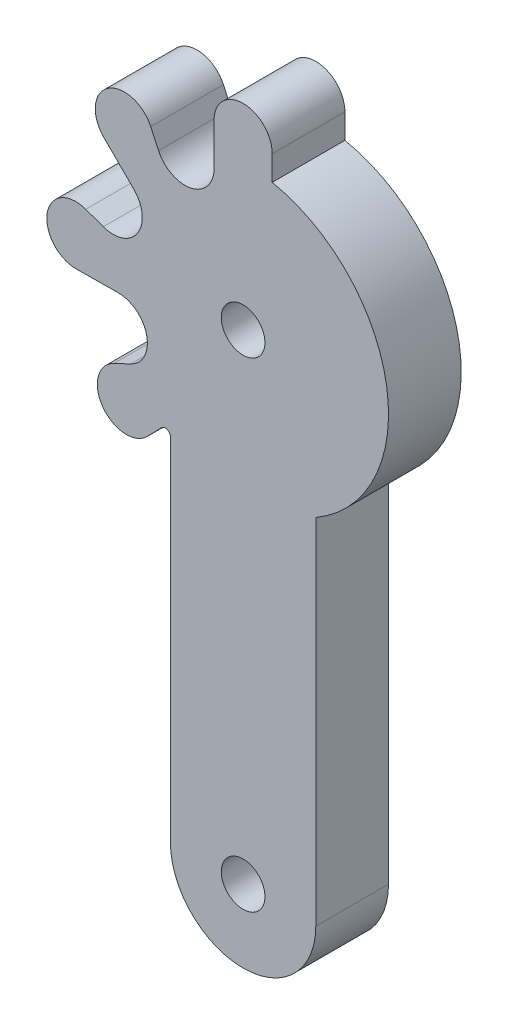
ISO-10303-21;
HEADER;
FILE_DESCRIPTION(('STEP AP214'),'2;1');
FILE_NAME('part.step','',(''),(''),'','','');
FILE_SCHEMA(('AUTOMOTIVE_DESIGN { 1 0 10303 214 1 1 1 1 }'));
ENDSEC;
DATA;
#1=APPLICATION_CONTEXT('core data for automotive mechanical design processes');
#2=APPLICATION_PROTOCOL_DEFINITION('international standard','automotive_design',2000,#1);
#3=PRODUCT_CONTEXT('',#1,'mechanical');
#4=PRODUCT('Part','Part','',(#3));
#5=PRODUCT_RELATED_PRODUCT_CATEGORY('part','',(#4));
#6=PRODUCT_DEFINITION_FORMATION('','',#4);
#7=PRODUCT_DEFINITION_CONTEXT('part definition',#1,'design');
#8=PRODUCT_DEFINITION('design','',#6,#7);
#9=PRODUCT_DEFINITION_SHAPE('','',#8);
#10=(LENGTH_UNIT() NAMED_UNIT(*) SI_UNIT(.MILLI.,.METRE.));
#11=(NAMED_UNIT(*) PLANE_ANGLE_UNIT() SI_UNIT($,.RADIAN.));
#12=(NAMED_UNIT(*) SI_UNIT($,.STERADIAN.) SOLID_ANGLE_UNIT());
#13=UNCERTAINTY_MEASURE_WITH_UNIT(LENGTH_MEASURE(1.E-05),#10,'distance_accuracy_value','');
#14=(GEOMETRIC_REPRESENTATION_CONTEXT(3) GLOBAL_UNCERTAINTY_ASSIGNED_CONTEXT((#13)) GLOBAL_UNIT_ASSIGNED_CONTEXT((#10,
#11,#12)) REPRESENTATION_CONTEXT('',''));
#15=CARTESIAN_POINT('',(0.,0.,0.));
#16=DIRECTION('',(0.,0.,1.));
#17=DIRECTION('',(1.,0.,0.));
#18=AXIS2_PLACEMENT_3D('',#15,#16,#17);
#19=CARTESIAN_POINT('',(-5.35045624859812,-8.86028004557311,5.));
#20=DIRECTION('',(0.,0.,-1.));
#21=DIRECTION('',(-1.,0.,0.));
#22=AXIS2_PLACEMENT_3D('',#19,#20,#21);
#23=CYLINDRICAL_SURFACE('',#22,0.350456248598112);
#24=CARTESIAN_POINT('',(-5.35045624859812,-8.86028004557311,0.));
#25=DIRECTION('',(0.,0.,1.));
#26=DIRECTION('',(1.,0.,0.));
#27=AXIS2_PLACEMENT_3D('',#24,#25,#26);
#28=CIRCLE('',#27,0.350456248598112);
#29=CARTESIAN_POINT('',(-5.00000000000001,-8.86028004557311,0.));
#30=VERTEX_POINT('',#29);
#31=CARTESIAN_POINT('',(-5.60147953192162,-8.61572556613968,0.));
#32=VERTEX_POINT('',#31);
#33=EDGE_CURVE('E254',#30,#32,#28,.T.);
#34=ORIENTED_EDGE('',*,*,#33,.F.);
#35=DIRECTION('',(0.,0.,-1.));
#36=VECTOR('',#35,1.);
#37=CARTESIAN_POINT('',(-5.00000000000001,-8.86028004557311,5.));
#38=LINE('',#37,#36);
#39=CARTESIAN_POINT('',(-5.00000000000001,-8.86028004557311,5.));
#40=VERTEX_POINT('',#39);
#41=EDGE_CURVE('E11',#40,#30,#38,.T.);
#42=ORIENTED_EDGE('',*,*,#41,.F.);
#43=CARTESIAN_POINT('',(-5.35045624859812,-8.86028004557311,5.));
#44=DIRECTION('',(0.,0.,1.));
#45=DIRECTION('',(1.,0.,0.));
#46=AXIS2_PLACEMENT_3D('',#43,#44,#45);
#47=CIRCLE('',#46,0.350456248598112);
#48=CARTESIAN_POINT('',(-5.60147953192162,-8.61572556613968,5.));
#49=VERTEX_POINT('',#48);
#50=EDGE_CURVE('E407',#40,#49,#47,.T.);
#51=ORIENTED_EDGE('',*,*,#50,.T.);
#52=DIRECTION('',(0.,0.,-1.));
#53=VECTOR('',#52,1.);
#54=CARTESIAN_POINT('',(-5.60147953192162,-8.61572556613968,5.));
#55=LINE('',#54,#53);
#56=EDGE_CURVE('E123',#49,#32,#55,.T.);
#57=ORIENTED_EDGE('',*,*,#56,.T.);
#58=EDGE_LOOP('',(#34,#42,#51,#57));
#59=FACE_BOUND('',#58,.T.);
#60=ADVANCED_FACE('F36',(#59),#23,.F.);
#61=CARTESIAN_POINT('',(-5.,0.,5.));
#62=DIRECTION('',(1.,0.,0.));
#63=DIRECTION('',(0.,1.,0.));
#64=AXIS2_PLACEMENT_3D('',#61,#62,#63);
#65=PLANE('',#64);
#66=DIRECTION('',(0.,-1.,0.));
#67=VECTOR('',#66,1.);
#68=CARTESIAN_POINT('',(-5.,0.,0.));
#69=LINE('',#68,#67);
#70=CARTESIAN_POINT('',(-5.00000000000005,-33.,0.));
#71=VERTEX_POINT('',#70);
#72=EDGE_CURVE('E252',#30,#71,#69,.T.);
#73=ORIENTED_EDGE('',*,*,#72,.T.);
#74=DIRECTION('',(0.,0.,-1.));
#75=VECTOR('',#74,1.);
#76=CARTESIAN_POINT('',(-5.00000000000005,-33.,5.));
#77=LINE('',#76,#75);
#78=CARTESIAN_POINT('',(-5.00000000000005,-33.,5.));
#79=VERTEX_POINT('',#78);
#80=EDGE_CURVE('E45',#79,#71,#77,.T.);
#81=ORIENTED_EDGE('',*,*,#80,.F.);
#82=DIRECTION('',(0.,-1.,0.));
#83=VECTOR('',#82,1.);
#84=CARTESIAN_POINT('',(-5.,0.,5.));
#85=LINE('',#84,#83);
#86=EDGE_CURVE('E409',#40,#79,#85,.T.);
#87=ORIENTED_EDGE('',*,*,#86,.F.);
#88=ORIENTED_EDGE('',*,*,#41,.T.);
#89=EDGE_LOOP('',(#73,#81,#87,#88));
#90=FACE_BOUND('',#89,.T.);
#91=ADVANCED_FACE('F253',(#90),#65,.F.);
#92=CARTESIAN_POINT('',(0.,-33.,5.));
#93=DIRECTION('',(0.,0.,-1.));
#94=DIRECTION('',(-1.,0.,0.));
#95=AXIS2_PLACEMENT_3D('',#92,#93,#94);
#96=CYLINDRICAL_SURFACE('',#95,5.00000000000002);
#97=CARTESIAN_POINT('',(0.,-33.,0.));
#98=DIRECTION('',(0.,0.,1.));
#99=DIRECTION('',(1.,0.,0.));
#100=AXIS2_PLACEMENT_3D('',#97,#98,#99);
#101=CIRCLE('',#100,5.00000000000002);
#102=CARTESIAN_POINT('',(5.,-33.,0.));
#103=VERTEX_POINT('',#102);
#104=EDGE_CURVE('E246',#71,#103,#101,.T.);
#105=ORIENTED_EDGE('',*,*,#104,.T.);
#106=DIRECTION('',(0.,0.,-1.));
#107=VECTOR('',#106,1.);
#108=CARTESIAN_POINT('',(5.,-33.,5.));
#109=LINE('',#108,#107);
#110=CARTESIAN_POINT('',(5.,-33.,5.));
#111=VERTEX_POINT('',#110);
#112=EDGE_CURVE('E238',#111,#103,#109,.T.);
#113=ORIENTED_EDGE('',*,*,#112,.F.);
#114=CARTESIAN_POINT('',(0.,-33.,5.));
#115=DIRECTION('',(0.,0.,1.));
#116=DIRECTION('',(1.,0.,0.));
#117=AXIS2_PLACEMENT_3D('',#114,#115,#116);
#118=CIRCLE('',#117,5.00000000000002);
#119=EDGE_CURVE('E248',#79,#111,#118,.T.);
#120=ORIENTED_EDGE('',*,*,#119,.F.);
#121=ORIENTED_EDGE('',*,*,#80,.T.);
#122=EDGE_LOOP('',(#105,#113,#120,#121));
#123=FACE_BOUND('',#122,.T.);
#124=ADVANCED_FACE('F244',(#123),#96,.T.);
#125=CARTESIAN_POINT('',(5.,0.,5.));
#126=DIRECTION('',(1.,0.,0.));
#127=DIRECTION('',(0.,1.,0.));
#128=AXIS2_PLACEMENT_3D('',#125,#126,#127);
#129=PLANE('',#128);
#130=DIRECTION('',(0.,-1.,0.));
#131=VECTOR('',#130,1.);
#132=CARTESIAN_POINT('',(5.,0.,0.));
#133=LINE('',#132,#131);
#134=CARTESIAN_POINT('',(5.,-8.66025403784439,0.));
#135=VERTEX_POINT('',#134);
#136=EDGE_CURVE('E256',#135,#103,#133,.T.);
#137=ORIENTED_EDGE('',*,*,#136,.F.);
#138=DIRECTION('',(0.,0.,-1.));
#139=VECTOR('',#138,1.);
#140=CARTESIAN_POINT('',(5.,-8.66025403784439,5.));
#141=LINE('',#140,#139);
#142=CARTESIAN_POINT('',(5.,-8.66025403784439,5.));
#143=VERTEX_POINT('',#142);
#144=EDGE_CURVE('E236',#143,#135,#141,.T.);
#145=ORIENTED_EDGE('',*,*,#144,.F.);
#146=DIRECTION('',(0.,-1.,0.));
#147=VECTOR('',#146,1.);
#148=CARTESIAN_POINT('',(5.,0.,5.));
#149=LINE('',#148,#147);
#150=EDGE_CURVE('E414',#143,#111,#149,.T.);
#151=ORIENTED_EDGE('',*,*,#150,.T.);
#152=ORIENTED_EDGE('',*,*,#112,.T.);
#153=EDGE_LOOP('',(#137,#145,#151,#152));
#154=FACE_BOUND('',#153,.T.);
#155=ADVANCED_FACE('F340',(#154),#129,.T.);
#156=CARTESIAN_POINT('',(0.,0.,5.));
#157=DIRECTION('',(0.,0.,-1.));
#158=DIRECTION('',(-1.,0.,0.));
#159=AXIS2_PLACEMENT_3D('',#156,#157,#158);
#160=CYLINDRICAL_SURFACE('',#159,10.);
#161=CARTESIAN_POINT('',(0.,0.,0.));
#162=DIRECTION('',(0.,0.,1.));
#163=DIRECTION('',(1.,0.,0.));
#164=AXIS2_PLACEMENT_3D('',#161,#162,#163);
#165=CIRCLE('',#164,10.);
#166=CARTESIAN_POINT('',(2.0022697448932,9.7974953875307,0.));
#167=VERTEX_POINT('',#166);
#168=EDGE_CURVE('E263',#135,#167,#165,.T.);
#169=ORIENTED_EDGE('',*,*,#168,.T.);
#170=DIRECTION('',(0.,0.,-1.));
#171=VECTOR('',#170,1.);
#172=CARTESIAN_POINT('',(2.0022697448932,9.7974953875307,5.));
#173=LINE('',#172,#171);
#174=CARTESIAN_POINT('',(2.0022697448932,9.7974953875307,5.));
#175=VERTEX_POINT('',#174);
#176=EDGE_CURVE('E233',#175,#167,#173,.T.);
#177=ORIENTED_EDGE('',*,*,#176,.F.);
#178=CARTESIAN_POINT('',(0.,0.,5.));
#179=DIRECTION('',(0.,0.,1.));
#180=DIRECTION('',(1.,0.,0.));
#181=AXIS2_PLACEMENT_3D('',#178,#179,#180);
#182=CIRCLE('',#181,10.);
#183=EDGE_CURVE('E417',#143,#175,#182,.T.);
#184=ORIENTED_EDGE('',*,*,#183,.F.);
#185=ORIENTED_EDGE('',*,*,#144,.T.);
#186=EDGE_LOOP('',(#169,#177,#184,#185));
#187=FACE_BOUND('',#186,.T.);
#188=ADVANCED_FACE('F343',(#187),#160,.T.);
#189=CARTESIAN_POINT('',(1.99999989266227,-0.000463331633490622,5.));
#190=DIRECTION('',(-0.999999973165473,0.00023166582296191,0.));
#191=DIRECTION('',(-0.00023166582296191,-0.999999973165473,0.));
#192=AXIS2_PLACEMENT_3D('',#189,#190,#191);
#193=PLANE('',#192);
#194=DIRECTION('',(0.00023166582296191,0.999999973165473,0.));
#195=VECTOR('',#194,1.);
#196=CARTESIAN_POINT('',(1.99999989266227,-0.000463331633490622,0.));
#197=LINE('',#196,#195);
#198=CARTESIAN_POINT('',(2.00266415696441,11.4999996912954,0.));
#199=VERTEX_POINT('',#198);
#200=EDGE_CURVE('E266',#167,#199,#197,.T.);
#201=ORIENTED_EDGE('',*,*,#200,.T.);
#202=DIRECTION('',(0.,0.,-1.));
#203=VECTOR('',#202,1.);
#204=CARTESIAN_POINT('',(2.00266415696441,11.4999996912954,5.));
#205=LINE('',#204,#203);
#206=CARTESIAN_POINT('',(2.00266415696441,11.4999996912954,5.));
#207=VERTEX_POINT('',#206);
#208=EDGE_CURVE('E230',#207,#199,#205,.T.);
#209=ORIENTED_EDGE('',*,*,#208,.F.);
#210=DIRECTION('',(0.00023166582296191,0.999999973165473,0.));
#211=VECTOR('',#210,1.);
#212=CARTESIAN_POINT('',(1.99999989266227,-0.000463331633490622,5.));
#213=LINE('',#212,#211);
#214=EDGE_CURVE('E420',#175,#207,#213,.T.);
#215=ORIENTED_EDGE('',*,*,#214,.F.);
#216=ORIENTED_EDGE('',*,*,#176,.T.);
#217=EDGE_LOOP('',(#201,#209,#215,#216));
#218=FACE_BOUND('',#217,.T.);
#219=ADVANCED_FACE('F347',(#218),#193,.F.);
#220=CARTESIAN_POINT('',(0.00266415685684293,11.4999996912954,5.));
#221=DIRECTION('',(0.,0.,-1.));
#222=DIRECTION('',(-1.,0.,0.));
#223=AXIS2_PLACEMENT_3D('',#220,#221,#222);
#224=CYLINDRICAL_SURFACE('',#223,2.00000000010754);
#225=CARTESIAN_POINT('',(0.00266415685684293,11.4999996912954,0.));
#226=DIRECTION('',(0.,0.,1.));
#227=DIRECTION('',(1.,0.,0.));
#228=AXIS2_PLACEMENT_3D('',#225,#226,#227);
#229=CIRCLE('',#228,2.00000000010754);
#230=CARTESIAN_POINT('',(-1.99733584325066,11.4999996912954,0.));
#231=VERTEX_POINT('',#230);
#232=EDGE_CURVE('E269',#199,#231,#229,.T.);
#233=ORIENTED_EDGE('',*,*,#232,.T.);
#234=DIRECTION('',(0.,0.,-1.));
#235=VECTOR('',#234,1.);
#236=CARTESIAN_POINT('',(-1.99733584325066,11.4999996912954,5.));
#237=LINE('',#236,#235);
#238=CARTESIAN_POINT('',(-1.99733584325066,11.4999996912954,5.));
#239=VERTEX_POINT('',#238);
#240=EDGE_CURVE('E228',#239,#231,#237,.T.);
#241=ORIENTED_EDGE('',*,*,#240,.F.);
#242=CARTESIAN_POINT('',(0.00266415685684293,11.4999996912954,5.));
#243=DIRECTION('',(0.,0.,1.));
#244=DIRECTION('',(1.,0.,0.));
#245=AXIS2_PLACEMENT_3D('',#242,#243,#244);
#246=CIRCLE('',#245,2.00000000010754);
#247=EDGE_CURVE('E423',#207,#239,#246,.T.);
#248=ORIENTED_EDGE('',*,*,#247,.F.);
#249=ORIENTED_EDGE('',*,*,#208,.T.);
#250=EDGE_LOOP('',(#233,#241,#248,#249));
#251=FACE_BOUND('',#250,.T.);
#252=ADVANCED_FACE('F351',(#251),#224,.T.);
#253=CARTESIAN_POINT('',(-1.99999989266191,0.00046333159615176,5.));
#254=DIRECTION('',(-0.999999973165477,0.000231665804292521,0.));
#255=DIRECTION('',(-0.000231665804292521,-0.999999973165477,0.));
#256=AXIS2_PLACEMENT_3D('',#253,#254,#255);
#257=PLANE('',#256);
#258=DIRECTION('',(0.000231665804292521,0.999999973165477,0.));
#259=VECTOR('',#258,1.);
#260=CARTESIAN_POINT('',(-1.99999989266191,0.00046333159615176,0.));
#261=LINE('',#260,#259);
#262=CARTESIAN_POINT('',(-1.99800366456741,8.61730709508782,0.));
#263=VERTEX_POINT('',#262);
#264=EDGE_CURVE('E272',#263,#231,#261,.T.);
#265=ORIENTED_EDGE('',*,*,#264,.F.);
#266=DIRECTION('',(0.,0.,-1.));
#267=VECTOR('',#266,1.);
#268=CARTESIAN_POINT('',(-1.99800366456741,8.61730709508782,5.));
#269=LINE('',#268,#267);
#270=CARTESIAN_POINT('',(-1.99800366456741,8.61730709508782,5.));
#271=VERTEX_POINT('',#270);
#272=EDGE_CURVE('E226',#271,#263,#269,.T.);
#273=ORIENTED_EDGE('',*,*,#272,.F.);
#274=DIRECTION('',(0.000231665804292521,0.999999973165477,0.));
#275=VECTOR('',#274,1.);
#276=CARTESIAN_POINT('',(-1.99999989266191,0.00046333159615176,5.));
#277=LINE('',#276,#275);
#278=EDGE_CURVE('E425',#271,#239,#277,.T.);
#279=ORIENTED_EDGE('',*,*,#278,.T.);
#280=ORIENTED_EDGE('',*,*,#240,.T.);
#281=EDGE_LOOP('',(#265,#273,#279,#280));
#282=FACE_BOUND('',#281,.T.);
#283=ADVANCED_FACE('F355',(#282),#257,.T.);
#284=CARTESIAN_POINT('',(-3.99800361089841,8.61777042669641,5.));
#285=DIRECTION('',(0.,0.,-1.));
#286=DIRECTION('',(-1.,0.,0.));
#287=AXIS2_PLACEMENT_3D('',#284,#285,#286);
#288=CYLINDRICAL_SURFACE('',#287,2.00000000000005);
#289=CARTESIAN_POINT('',(-3.99800361089841,8.61777042669641,0.));
#290=DIRECTION('',(0.,0.,1.));
#291=DIRECTION('',(1.,0.,0.));
#292=AXIS2_PLACEMENT_3D('',#289,#290,#291);
#293=CIRCLE('',#292,2.00000000000005);
#294=CARTESIAN_POINT('',(-5.8122708813228,7.77608505111534,0.));
#295=VERTEX_POINT('',#294);
#296=EDGE_CURVE('E275',#295,#263,#293,.T.);
#297=ORIENTED_EDGE('',*,*,#296,.F.);
#298=DIRECTION('',(0.,0.,-1.));
#299=VECTOR('',#298,1.);
#300=CARTESIAN_POINT('',(-5.8122708813228,7.77608505111534,5.));
#301=LINE('',#300,#299);
#302=CARTESIAN_POINT('',(-5.8122708813228,7.77608505111534,5.));
#303=VERTEX_POINT('',#302);
#304=EDGE_CURVE('E224',#303,#295,#301,.T.);
#305=ORIENTED_EDGE('',*,*,#304,.F.);
#306=CARTESIAN_POINT('',(-3.99800361089841,8.61777042669641,5.));
#307=DIRECTION('',(0.,0.,1.));
#308=DIRECTION('',(1.,0.,0.));
#309=AXIS2_PLACEMENT_3D('',#306,#307,#308);
#310=CIRCLE('',#309,2.00000000000005);
#311=EDGE_CURVE('E428',#303,#271,#310,.T.);
#312=ORIENTED_EDGE('',*,*,#311,.T.);
#313=ORIENTED_EDGE('',*,*,#272,.T.);
#314=EDGE_LOOP('',(#297,#305,#312,#313));
#315=FACE_BOUND('',#314,.T.);
#316=ADVANCED_FACE('F359',(#315),#288,.F.);
#317=CARTESIAN_POINT('',(-1.81426745825188,-0.841684970715458,5.));
#318=DIRECTION('',(-0.907133729125938,-0.420842485357727,0.));
#319=DIRECTION('',(0.420842485357727,-0.907133729125938,0.));
#320=AXIS2_PLACEMENT_3D('',#317,#318,#319);
#321=PLANE('',#320);
#322=DIRECTION('',(-0.420842485357727,0.907133729125938,0.));
#323=VECTOR('',#322,1.);
#324=CARTESIAN_POINT('',(-1.81426745825188,-0.841684970715458,0.));
#325=LINE('',#324,#323);
#326=CARTESIAN_POINT('',(-6.35176158076298,8.93896719120139,0.));
#327=VERTEX_POINT('',#326);
#328=EDGE_CURVE('E278',#295,#327,#325,.T.);
#329=ORIENTED_EDGE('',*,*,#328,.T.);
#330=DIRECTION('',(0.,0.,-1.));
#331=VECTOR('',#330,1.);
#332=CARTESIAN_POINT('',(-6.35176158076298,8.93896719120139,5.));
#333=LINE('',#332,#331);
#334=CARTESIAN_POINT('',(-6.35176158076298,8.93896719120139,5.));
#335=VERTEX_POINT('',#334);
#336=EDGE_CURVE('E221',#335,#327,#333,.T.);
#337=ORIENTED_EDGE('',*,*,#336,.F.);
#338=DIRECTION('',(-0.420842485357727,0.907133729125938,0.));
#339=VECTOR('',#338,1.);
#340=CARTESIAN_POINT('',(-1.81426745825188,-0.841684970715458,5.));
#341=LINE('',#340,#339);
#342=EDGE_CURVE('E431',#303,#335,#341,.T.);
#343=ORIENTED_EDGE('',*,*,#342,.F.);
#344=ORIENTED_EDGE('',*,*,#304,.T.);
#345=EDGE_LOOP('',(#329,#337,#343,#344));
#346=FACE_BOUND('',#345,.T.);
#347=ADVANCED_FACE('F363',(#346),#321,.F.);
#348=CARTESIAN_POINT('',(-8.16602885118736,8.09728181562032,5.));
#349=DIRECTION('',(0.,0.,-1.));
#350=DIRECTION('',(-1.,0.,0.));
#351=AXIS2_PLACEMENT_3D('',#348,#349,#350);
#352=CYLINDRICAL_SURFACE('',#351,2.00000000000003);
#353=CARTESIAN_POINT('',(-8.16602885118736,8.09728181562032,0.));
#354=DIRECTION('',(0.,0.,1.));
#355=DIRECTION('',(1.,0.,0.));
#356=AXIS2_PLACEMENT_3D('',#353,#354,#355);
#357=CIRCLE('',#356,2.00000000000003);
#358=CARTESIAN_POINT('',(-9.57425177564307,6.67710288497904,0.));
#359=VERTEX_POINT('',#358);
#360=EDGE_CURVE('E281',#327,#359,#357,.T.);
#361=ORIENTED_EDGE('',*,*,#360,.T.);
#362=DIRECTION('',(0.,0.,-1.));
#363=VECTOR('',#362,1.);
#364=CARTESIAN_POINT('',(-9.57425177564307,6.67710288497904,5.));
#365=LINE('',#364,#363);
#366=CARTESIAN_POINT('',(-9.57425177564307,6.67710288497904,5.));
#367=VERTEX_POINT('',#366);
#368=EDGE_CURVE('E218',#367,#359,#365,.T.);
#369=ORIENTED_EDGE('',*,*,#368,.F.);
#370=CARTESIAN_POINT('',(-8.16602885118736,8.09728181562032,5.));
#371=DIRECTION('',(0.,0.,1.));
#372=DIRECTION('',(1.,0.,0.));
#373=AXIS2_PLACEMENT_3D('',#370,#371,#372);
#374=CIRCLE('',#373,2.00000000000003);
#375=EDGE_CURVE('E434',#335,#367,#374,.T.);
#376=ORIENTED_EDGE('',*,*,#375,.F.);
#377=ORIENTED_EDGE('',*,*,#336,.T.);
#378=EDGE_LOOP('',(#361,#369,#376,#377));
#379=FACE_BOUND('',#378,.T.);
#380=ADVANCED_FACE('F367',(#379),#352,.T.);
#381=CARTESIAN_POINT('',(-1.40822292445571,-1.42017893064128,5.));
#382=DIRECTION('',(0.704111462227854,0.71008946532064,0.));
#383=DIRECTION('',(-0.71008946532064,0.704111462227854,0.));
#384=AXIS2_PLACEMENT_3D('',#381,#382,#383);
#385=PLANE('',#384);
#386=DIRECTION('',(0.71008946532064,-0.704111462227854,0.));
#387=VECTOR('',#386,1.);
#388=CARTESIAN_POINT('',(-1.40822292445571,-1.42017893064128,0.));
#389=LINE('',#388,#387);
#390=CARTESIAN_POINT('',(-7.52695305172738,4.64703967672883,0.));
#391=VERTEX_POINT('',#390);
#392=EDGE_CURVE('E284',#359,#391,#389,.T.);
#393=ORIENTED_EDGE('',*,*,#392,.T.);
#394=DIRECTION('',(0.,0.,-1.));
#395=VECTOR('',#394,1.);
#396=CARTESIAN_POINT('',(-7.52695305172738,4.64703967672883,5.));
#397=LINE('',#396,#395);
#398=CARTESIAN_POINT('',(-7.52695305172738,4.64703967672883,5.));
#399=VERTEX_POINT('',#398);
#400=EDGE_CURVE('E216',#399,#391,#397,.T.);
#401=ORIENTED_EDGE('',*,*,#400,.F.);
#402=DIRECTION('',(0.71008946532064,-0.704111462227854,0.));
#403=VECTOR('',#402,1.);
#404=CARTESIAN_POINT('',(-1.40822292445571,-1.42017893064128,5.));
#405=LINE('',#404,#403);
#406=EDGE_CURVE('E437',#367,#399,#405,.T.);
#407=ORIENTED_EDGE('',*,*,#406,.F.);
#408=ORIENTED_EDGE('',*,*,#368,.T.);
#409=EDGE_LOOP('',(#393,#401,#407,#408));
#410=FACE_BOUND('',#409,.T.);
#411=ADVANCED_FACE('F371',(#410),#385,.F.);
#412=CARTESIAN_POINT('',(-8.93517597618308,3.22686074608754,5.));
#413=DIRECTION('',(0.,0.,-1.));
#414=DIRECTION('',(-1.,0.,0.));
#415=AXIS2_PLACEMENT_3D('',#412,#413,#414);
#416=CYLINDRICAL_SURFACE('',#415,2.);
#417=CARTESIAN_POINT('',(-8.93517597618308,3.22686074608754,0.));
#418=DIRECTION('',(0.,0.,1.));
#419=DIRECTION('',(1.,0.,0.));
#420=AXIS2_PLACEMENT_3D('',#417,#418,#419);
#421=CIRCLE('',#420,2.);
#422=CARTESIAN_POINT('',(-9.61451508062257,1.34577106689111,0.));
#423=VERTEX_POINT('',#422);
#424=EDGE_CURVE('E287',#423,#391,#421,.T.);
#425=ORIENTED_EDGE('',*,*,#424,.F.);
#426=DIRECTION('',(0.,0.,-1.));
#427=VECTOR('',#426,1.);
#428=CARTESIAN_POINT('',(-9.61451508062257,1.34577106689111,5.));
#429=LINE('',#428,#427);
#430=CARTESIAN_POINT('',(-9.61451508062257,1.34577106689111,5.));
#431=VERTEX_POINT('',#430);
#432=EDGE_CURVE('E214',#431,#423,#429,.T.);
#433=ORIENTED_EDGE('',*,*,#432,.F.);
#434=CARTESIAN_POINT('',(-8.93517597618308,3.22686074608754,5.));
#435=DIRECTION('',(0.,0.,1.));
#436=DIRECTION('',(1.,0.,0.));
#437=AXIS2_PLACEMENT_3D('',#434,#435,#436);
#438=CIRCLE('',#437,2.);
#439=EDGE_CURVE('E439',#431,#399,#438,.T.);
#440=ORIENTED_EDGE('',*,*,#439,.T.);
#441=ORIENTED_EDGE('',*,*,#400,.T.);
#442=EDGE_LOOP('',(#425,#433,#440,#441));
#443=FACE_BOUND('',#442,.T.);
#444=ADVANCED_FACE('F375',(#443),#416,.F.);
#445=CARTESIAN_POINT('',(-0.679339104439482,-1.88108967919644,5.));
#446=DIRECTION('',(-0.339669552219741,-0.94054483959822,0.));
#447=DIRECTION('',(0.94054483959822,-0.339669552219741,0.));
#448=AXIS2_PLACEMENT_3D('',#445,#446,#447);
#449=PLANE('',#448);
#450=DIRECTION('',(-0.94054483959822,0.339669552219741,0.));
#451=VECTOR('',#450,1.);
#452=CARTESIAN_POINT('',(-0.679339104439482,-1.88108967919644,0.));
#453=LINE('',#452,#451);
#454=CARTESIAN_POINT('',(-10.8202270933202,1.78120342717487,0.));
#455=VERTEX_POINT('',#454);
#456=EDGE_CURVE('E290',#423,#455,#453,.T.);
#457=ORIENTED_EDGE('',*,*,#456,.T.);
#458=DIRECTION('',(0.,0.,-1.));
#459=VECTOR('',#458,1.);
#460=CARTESIAN_POINT('',(-10.8202270933202,1.78120342717487,5.));
#461=LINE('',#460,#459);
#462=CARTESIAN_POINT('',(-10.8202270933202,1.78120342717487,5.));
#463=VERTEX_POINT('',#462);
#464=EDGE_CURVE('E211',#463,#455,#461,.T.);
#465=ORIENTED_EDGE('',*,*,#464,.F.);
#466=DIRECTION('',(-0.94054483959822,0.339669552219741,0.));
#467=VECTOR('',#466,1.);
#468=CARTESIAN_POINT('',(-0.679339104439482,-1.88108967919644,5.));
#469=LINE('',#468,#467);
#470=EDGE_CURVE('E442',#431,#463,#469,.T.);
#471=ORIENTED_EDGE('',*,*,#470,.F.);
#472=ORIENTED_EDGE('',*,*,#432,.T.);
#473=EDGE_LOOP('',(#457,#465,#471,#472));
#474=FACE_BOUND('',#473,.T.);
#475=ADVANCED_FACE('F379',(#474),#449,.F.);
#476=CARTESIAN_POINT('',(-11.4995661977597,-0.0998862520215707,5.));
#477=DIRECTION('',(0.,0.,-1.));
#478=DIRECTION('',(-1.,0.,0.));
#479=AXIS2_PLACEMENT_3D('',#476,#477,#478);
#480=CYLINDRICAL_SURFACE('',#479,2.);
#481=CARTESIAN_POINT('',(-11.4995661977597,-0.0998862520215707,0.));
#482=DIRECTION('',(0.,0.,1.));
#483=DIRECTION('',(1.,0.,0.));
#484=AXIS2_PLACEMENT_3D('',#481,#482,#483);
#485=CIRCLE('',#484,2.);
#486=CARTESIAN_POINT('',(-11.4995661977597,-2.09988625202157,0.));
#487=VERTEX_POINT('',#486);
#488=EDGE_CURVE('E293',#455,#487,#485,.T.);
#489=ORIENTED_EDGE('',*,*,#488,.T.);
#490=DIRECTION('',(0.,0.,-1.));
#491=VECTOR('',#490,1.);
#492=CARTESIAN_POINT('',(-11.4995661977597,-2.09988625202157,5.));
#493=LINE('',#492,#491);
#494=CARTESIAN_POINT('',(-11.4995661977597,-2.09988625202157,5.));
#495=VERTEX_POINT('',#494);
#496=EDGE_CURVE('E208',#495,#487,#493,.T.);
#497=ORIENTED_EDGE('',*,*,#496,.F.);
#498=CARTESIAN_POINT('',(-11.4995661977597,-0.0998862520215707,5.));
#499=DIRECTION('',(0.,0.,1.));
#500=DIRECTION('',(1.,0.,0.));
#501=AXIS2_PLACEMENT_3D('',#498,#499,#500);
#502=CIRCLE('',#501,2.);
#503=EDGE_CURVE('E445',#463,#495,#502,.T.);
#504=ORIENTED_EDGE('',*,*,#503,.F.);
#505=ORIENTED_EDGE('',*,*,#464,.T.);
#506=EDGE_LOOP('',(#489,#497,#504,#505));
#507=FACE_BOUND('',#506,.T.);
#508=ADVANCED_FACE('F383',(#507),#480,.T.);
#509=CARTESIAN_POINT('',(0.0178419423203084,-1.99698464365536,5.));
#510=DIRECTION('',(-0.00893408485130189,0.999960090267542,0.));
#511=DIRECTION('',(-0.999960090267542,-0.00893408485130189,0.));
#512=AXIS2_PLACEMENT_3D('',#509,#510,#511);
#513=PLANE('',#512);
#514=DIRECTION('',(0.999960090267542,0.00893408485130189,0.));
#515=VECTOR('',#514,1.);
#516=CARTESIAN_POINT('',(0.0178419423203084,-1.99698464365536,0.));
#517=LINE('',#516,#515);
#518=CARTESIAN_POINT('',(-8.60002022085006,-2.07398042833912,0.));
#519=VERTEX_POINT('',#518);
#520=EDGE_CURVE('E296',#487,#519,#517,.T.);
#521=ORIENTED_EDGE('',*,*,#520,.T.);
#522=DIRECTION('',(0.,0.,-1.));
#523=VECTOR('',#522,1.);
#524=CARTESIAN_POINT('',(-8.60002022085006,-2.07398042833912,5.));
#525=LINE('',#524,#523);
#526=CARTESIAN_POINT('',(-8.60002022085006,-2.07398042833912,5.));
#527=VERTEX_POINT('',#526);
#528=EDGE_CURVE('E202',#527,#519,#525,.T.);
#529=ORIENTED_EDGE('',*,*,#528,.F.);
#530=DIRECTION('',(0.999960090267542,0.00893408485130189,0.));
#531=VECTOR('',#530,1.);
#532=CARTESIAN_POINT('',(0.0178419423203084,-1.99698464365536,5.));
#533=LINE('',#532,#531);
#534=EDGE_CURVE('E448',#495,#527,#533,.T.);
#535=ORIENTED_EDGE('',*,*,#534,.F.);
#536=ORIENTED_EDGE('',*,*,#496,.T.);
#537=EDGE_LOOP('',(#521,#529,#535,#536));
#538=FACE_BOUND('',#537,.T.);
#539=ADVANCED_FACE('F387',(#538),#513,.F.);
#540=CARTESIAN_POINT('',(-8.58215205114745,-4.0739006088742,5.));
#541=DIRECTION('',(0.,0.,-1.));
#542=DIRECTION('',(-1.,0.,0.));
#543=AXIS2_PLACEMENT_3D('',#540,#541,#542);
#544=CYLINDRICAL_SURFACE('',#543,2.);
#545=CARTESIAN_POINT('',(-8.58215205114745,-4.0739006088742,0.));
#546=DIRECTION('',(0.,0.,1.));
#547=DIRECTION('',(1.,0.,0.));
#548=AXIS2_PLACEMENT_3D('',#545,#546,#547);
#549=CIRCLE('',#548,2.);
#550=CARTESIAN_POINT('',(-7.72448876506867,-5.88066946174735,0.));
#551=VERTEX_POINT('',#550);
#552=EDGE_CURVE('E299',#551,#519,#549,.T.);
#553=ORIENTED_EDGE('',*,*,#552,.F.);
#554=DIRECTION('',(0.,0.,-1.));
#555=VECTOR('',#554,1.);
#556=CARTESIAN_POINT('',(-7.72448876506867,-5.88066946174735,5.));
#557=LINE('',#556,#555);
#558=CARTESIAN_POINT('',(-7.72448876506867,-5.88066946174735,5.));
#559=VERTEX_POINT('',#558);
#560=EDGE_CURVE('E200',#559,#551,#557,.T.);
#561=ORIENTED_EDGE('',*,*,#560,.F.);
#562=CARTESIAN_POINT('',(-8.58215205114745,-4.0739006088742,5.));
#563=DIRECTION('',(0.,0.,1.));
#564=DIRECTION('',(1.,0.,0.));
#565=AXIS2_PLACEMENT_3D('',#562,#563,#564);
#566=CIRCLE('',#565,2.);
#567=EDGE_CURVE('E194',#559,#527,#566,.T.);
#568=ORIENTED_EDGE('',*,*,#567,.T.);
#569=ORIENTED_EDGE('',*,*,#528,.T.);
#570=EDGE_LOOP('',(#553,#561,#568,#569));
#571=FACE_BOUND('',#570,.T.);
#572=ADVANCED_FACE('F391',(#571),#544,.F.);
#573=CARTESIAN_POINT('',(0.857663286078785,-1.80676885287317,5.));
#574=DIRECTION('',(0.428831643039387,-0.903384426436575,0.));
#575=DIRECTION('',(0.903384426436575,0.428831643039387,0.));
#576=AXIS2_PLACEMENT_3D('',#573,#574,#575);
#577=PLANE('',#576);
#578=DIRECTION('',(-0.903384426436575,-0.428831643039387,0.));
#579=VECTOR('',#578,1.);
#580=CARTESIAN_POINT('',(0.857663286078785,-1.80676885287317,0.));
#581=LINE('',#580,#579);
#582=CARTESIAN_POINT('',(-8.88256375435236,-6.43040132105809,0.));
#583=VERTEX_POINT('',#582);
#584=EDGE_CURVE('E199',#551,#583,#581,.T.);
#585=ORIENTED_EDGE('',*,*,#584,.T.);
#586=DIRECTION('',(0.,0.,-1.));
#587=VECTOR('',#586,1.);
#588=CARTESIAN_POINT('',(-8.88256375435236,-6.43040132105809,5.));
#589=LINE('',#588,#587);
#590=CARTESIAN_POINT('',(-8.88256375435236,-6.43040132105809,5.));
#591=VERTEX_POINT('',#590);
#592=EDGE_CURVE('E184',#591,#583,#589,.T.);
#593=ORIENTED_EDGE('',*,*,#592,.F.);
#594=DIRECTION('',(-0.903384426436575,-0.428831643039387,0.));
#595=VECTOR('',#594,1.);
#596=CARTESIAN_POINT('',(0.857663286078785,-1.80676885287317,5.));
#597=LINE('',#596,#595);
#598=EDGE_CURVE('E187',#559,#591,#597,.T.);
#599=ORIENTED_EDGE('',*,*,#598,.F.);
#600=ORIENTED_EDGE('',*,*,#560,.T.);
#601=EDGE_LOOP('',(#585,#593,#599,#600));
#602=FACE_BOUND('',#601,.T.);
#603=ADVANCED_FACE('F197',(#602),#577,.F.);
#604=CARTESIAN_POINT('',(-8.02490046827358,-8.23717017393124,5.));
#605=DIRECTION('',(0.,0.,-1.));
#606=DIRECTION('',(-1.,0.,0.));
#607=AXIS2_PLACEMENT_3D('',#604,#605,#606);
#608=CYLINDRICAL_SURFACE('',#607,2.);
#609=CARTESIAN_POINT('',(-8.02490046827358,-8.23717017393124,0.));
#610=DIRECTION('',(0.,0.,1.));
#611=DIRECTION('',(1.,0.,0.));
#612=AXIS2_PLACEMENT_3D('',#609,#610,#611);
#613=CIRCLE('',#612,2.);
#614=CARTESIAN_POINT('',(-6.59234913367685,-9.63280503797882,0.));
#615=VERTEX_POINT('',#614);
#616=EDGE_CURVE('E303',#583,#615,#613,.T.);
#617=ORIENTED_EDGE('',*,*,#616,.T.);
#618=DIRECTION('',(0.,0.,-1.));
#619=VECTOR('',#618,1.);
#620=CARTESIAN_POINT('',(-6.59234913367685,-9.63280503797882,5.));
#621=LINE('',#620,#619);
#622=CARTESIAN_POINT('',(-6.59234913367685,-9.63280503797882,5.));
#623=VERTEX_POINT('',#622);
#624=EDGE_CURVE('E186',#623,#615,#621,.T.);
#625=ORIENTED_EDGE('',*,*,#624,.F.);
#626=CARTESIAN_POINT('',(-8.02490046827358,-8.23717017393124,5.));
#627=DIRECTION('',(0.,0.,1.));
#628=DIRECTION('',(1.,0.,0.));
#629=AXIS2_PLACEMENT_3D('',#626,#627,#628);
#630=CIRCLE('',#629,2.);
#631=EDGE_CURVE('E179',#591,#623,#630,.T.);
#632=ORIENTED_EDGE('',*,*,#631,.F.);
#633=ORIENTED_EDGE('',*,*,#592,.T.);
#634=EDGE_LOOP('',(#617,#625,#632,#633));
#635=FACE_BOUND('',#634,.T.);
#636=ADVANCED_FACE('F182',(#635),#608,.T.);
#637=CARTESIAN_POINT('',(1.43255133459673,-1.39563486404757,5.));
#638=DIRECTION('',(-0.716275667298369,0.697817432023789,0.));
#639=DIRECTION('',(-0.697817432023789,-0.716275667298369,0.));
#640=AXIS2_PLACEMENT_3D('',#637,#638,#639);
#641=PLANE('',#640);
#642=DIRECTION('',(0.697817432023789,0.716275667298369,0.));
#643=VECTOR('',#642,1.);
#644=CARTESIAN_POINT('',(1.43255133459673,-1.39563486404757,0.));
#645=LINE('',#644,#643);
#646=EDGE_CURVE('E116',#615,#32,#645,.T.);
#647=ORIENTED_EDGE('',*,*,#646,.T.);
#648=ORIENTED_EDGE('',*,*,#56,.F.);
#649=DIRECTION('',(0.697817432023789,0.716275667298369,0.));
#650=VECTOR('',#649,1.);
#651=CARTESIAN_POINT('',(1.43255133459673,-1.39563486404757,5.));
#652=LINE('',#651,#650);
#653=EDGE_CURVE('E53',#623,#49,#652,.T.);
#654=ORIENTED_EDGE('',*,*,#653,.F.);
#655=ORIENTED_EDGE('',*,*,#624,.T.);
#656=EDGE_LOOP('',(#647,#648,#654,#655));
#657=FACE_BOUND('',#656,.T.);
#658=ADVANCED_FACE('F322',(#657),#641,.F.);
#659=CARTESIAN_POINT('',(0.,0.,5.));
#660=DIRECTION('',(0.,0.,-1.));
#661=DIRECTION('',(-1.,0.,0.));
#662=AXIS2_PLACEMENT_3D('',#659,#660,#661);
#663=CYLINDRICAL_SURFACE('',#662,1.5);
#664=CARTESIAN_POINT('',(0.,0.,5.));
#665=DIRECTION('',(0.,0.,1.));
#666=DIRECTION('',(1.,0.,0.));
#667=AXIS2_PLACEMENT_3D('',#664,#665,#666);
#668=CIRCLE('',#667,1.5);
#669=CARTESIAN_POINT('',(1.5,0.,5.));
#670=VERTEX_POINT('',#669);
#671=EDGE_CURVE('E308',#670,#670,#668,.T.);
#672=ORIENTED_EDGE('',*,*,#671,.T.);
#673=EDGE_LOOP('',(#672));
#674=FACE_BOUND('',#673,.T.);
#675=CARTESIAN_POINT('',(0.,0.,0.));
#676=DIRECTION('',(0.,0.,1.));
#677=DIRECTION('',(1.,0.,0.));
#678=AXIS2_PLACEMENT_3D('',#675,#676,#677);
#679=CIRCLE('',#678,1.5);
#680=CARTESIAN_POINT('',(1.5,0.,0.));
#681=VERTEX_POINT('',#680);
#682=EDGE_CURVE('E258',#681,#681,#679,.T.);
#683=ORIENTED_EDGE('',*,*,#682,.F.);
#684=EDGE_LOOP('',(#683));
#685=FACE_BOUND('',#684,.T.);
#686=ADVANCED_FACE('F38',(#674,#685),#663,.F.);
#687=CARTESIAN_POINT('',(0.,-33.,5.));
#688=DIRECTION('',(0.,0.,-1.));
#689=DIRECTION('',(-1.,0.,0.));
#690=AXIS2_PLACEMENT_3D('',#687,#688,#689);
#691=CYLINDRICAL_SURFACE('',#690,1.5);
#692=CARTESIAN_POINT('',(0.,-33.,5.));
#693=DIRECTION('',(0.,0.,1.));
#694=DIRECTION('',(1.,0.,0.));
#695=AXIS2_PLACEMENT_3D('',#692,#693,#694);
#696=CIRCLE('',#695,1.5);
#697=CARTESIAN_POINT('',(1.5,-33.,5.));
#698=VERTEX_POINT('',#697);
#699=EDGE_CURVE('E309',#698,#698,#696,.T.);
#700=ORIENTED_EDGE('',*,*,#699,.T.);
#701=EDGE_LOOP('',(#700));
#702=FACE_BOUND('',#701,.T.);
#703=CARTESIAN_POINT('',(0.,-33.,0.));
#704=DIRECTION('',(0.,0.,1.));
#705=DIRECTION('',(1.,0.,0.));
#706=AXIS2_PLACEMENT_3D('',#703,#704,#705);
#707=CIRCLE('',#706,1.5);
#708=CARTESIAN_POINT('',(1.5,-33.,0.));
#709=VERTEX_POINT('',#708);
#710=EDGE_CURVE('E306',#709,#709,#707,.T.);
#711=ORIENTED_EDGE('',*,*,#710,.F.);
#712=EDGE_LOOP('',(#711));
#713=FACE_BOUND('',#712,.T.);
#714=ADVANCED_FACE('F321',(#702,#713),#691,.F.);
#715=CARTESIAN_POINT('',(0.,0.,5.));
#716=DIRECTION('',(0.,0.,1.));
#717=DIRECTION('',(1.,0.,0.));
#718=AXIS2_PLACEMENT_3D('',#715,#716,#717);
#719=PLANE('',#718);
#720=ORIENTED_EDGE('',*,*,#671,.F.);
#721=EDGE_LOOP('',(#720));
#722=FACE_BOUND('',#721,.T.);
#723=ORIENTED_EDGE('',*,*,#50,.F.);
#724=ORIENTED_EDGE('',*,*,#86,.T.);
#725=ORIENTED_EDGE('',*,*,#119,.T.);
#726=ORIENTED_EDGE('',*,*,#150,.F.);
#727=ORIENTED_EDGE('',*,*,#183,.T.);
#728=ORIENTED_EDGE('',*,*,#214,.T.);
#729=ORIENTED_EDGE('',*,*,#247,.T.);
#730=ORIENTED_EDGE('',*,*,#278,.F.);
#731=ORIENTED_EDGE('',*,*,#311,.F.);
#732=ORIENTED_EDGE('',*,*,#342,.T.);
#733=ORIENTED_EDGE('',*,*,#375,.T.);
#734=ORIENTED_EDGE('',*,*,#406,.T.);
#735=ORIENTED_EDGE('',*,*,#439,.F.);
#736=ORIENTED_EDGE('',*,*,#470,.T.);
#737=ORIENTED_EDGE('',*,*,#503,.T.);
#738=ORIENTED_EDGE('',*,*,#534,.T.);
#739=ORIENTED_EDGE('',*,*,#567,.F.);
#740=ORIENTED_EDGE('',*,*,#598,.T.);
#741=ORIENTED_EDGE('',*,*,#631,.T.);
#742=ORIENTED_EDGE('',*,*,#653,.T.);
#743=EDGE_LOOP('',(#723,#724,#725,#726,#727,#728,#729,#730,#731,#732,#733,#734,#735,#736,#737,
#738,#739,#740,#741,#742));
#744=FACE_BOUND('',#743,.T.);
#745=ORIENTED_EDGE('',*,*,#699,.F.);
#746=EDGE_LOOP('',(#745));
#747=FACE_BOUND('',#746,.T.);
#748=ADVANCED_FACE('F191',(#722,#744,#747),#719,.T.);
#749=CARTESIAN_POINT('',(0.,0.,0.));
#750=DIRECTION('',(0.,0.,1.));
#751=DIRECTION('',(1.,0.,0.));
#752=AXIS2_PLACEMENT_3D('',#749,#750,#751);
#753=PLANE('',#752);
#754=ORIENTED_EDGE('',*,*,#682,.T.);
#755=EDGE_LOOP('',(#754));
#756=FACE_BOUND('',#755,.T.);
#757=ORIENTED_EDGE('',*,*,#33,.T.);
#758=ORIENTED_EDGE('',*,*,#646,.F.);
#759=ORIENTED_EDGE('',*,*,#616,.F.);
#760=ORIENTED_EDGE('',*,*,#584,.F.);
#761=ORIENTED_EDGE('',*,*,#552,.T.);
#762=ORIENTED_EDGE('',*,*,#520,.F.);
#763=ORIENTED_EDGE('',*,*,#488,.F.);
#764=ORIENTED_EDGE('',*,*,#456,.F.);
#765=ORIENTED_EDGE('',*,*,#424,.T.);
#766=ORIENTED_EDGE('',*,*,#392,.F.);
#767=ORIENTED_EDGE('',*,*,#360,.F.);
#768=ORIENTED_EDGE('',*,*,#328,.F.);
#769=ORIENTED_EDGE('',*,*,#296,.T.);
#770=ORIENTED_EDGE('',*,*,#264,.T.);
#771=ORIENTED_EDGE('',*,*,#232,.F.);
#772=ORIENTED_EDGE('',*,*,#200,.F.);
#773=ORIENTED_EDGE('',*,*,#168,.F.);
#774=ORIENTED_EDGE('',*,*,#136,.T.);
#775=ORIENTED_EDGE('',*,*,#104,.F.);
#776=ORIENTED_EDGE('',*,*,#72,.F.);
#777=EDGE_LOOP('',(#757,#758,#759,#760,#761,#762,#763,#764,#765,#766,#767,#768,#769,#770,#771,
#772,#773,#774,#775,#776));
#778=FACE_BOUND('',#777,.T.);
#779=ORIENTED_EDGE('',*,*,#710,.T.);
#780=EDGE_LOOP('',(#779));
#781=FACE_BOUND('',#780,.T.);
#782=ADVANCED_FACE('F318',(#756,#778,#781),#753,.F.);
#783=CLOSED_SHELL('',(#60,#91,#124,#155,#188,#219,#252,#283,#316,#347,#380,#411,#444,#475,#508,
#539,#572,#603,#636,#658,#686,#714,#748,#782));
#784=MANIFOLD_SOLID_BREP('B2',#783);
#785=ADVANCED_BREP_SHAPE_REPRESENTATION('',(#18,#784),#14);
#786=SHAPE_DEFINITION_REPRESENTATION(#9,#785);
ENDSEC;
END-ISO-10303-21;
